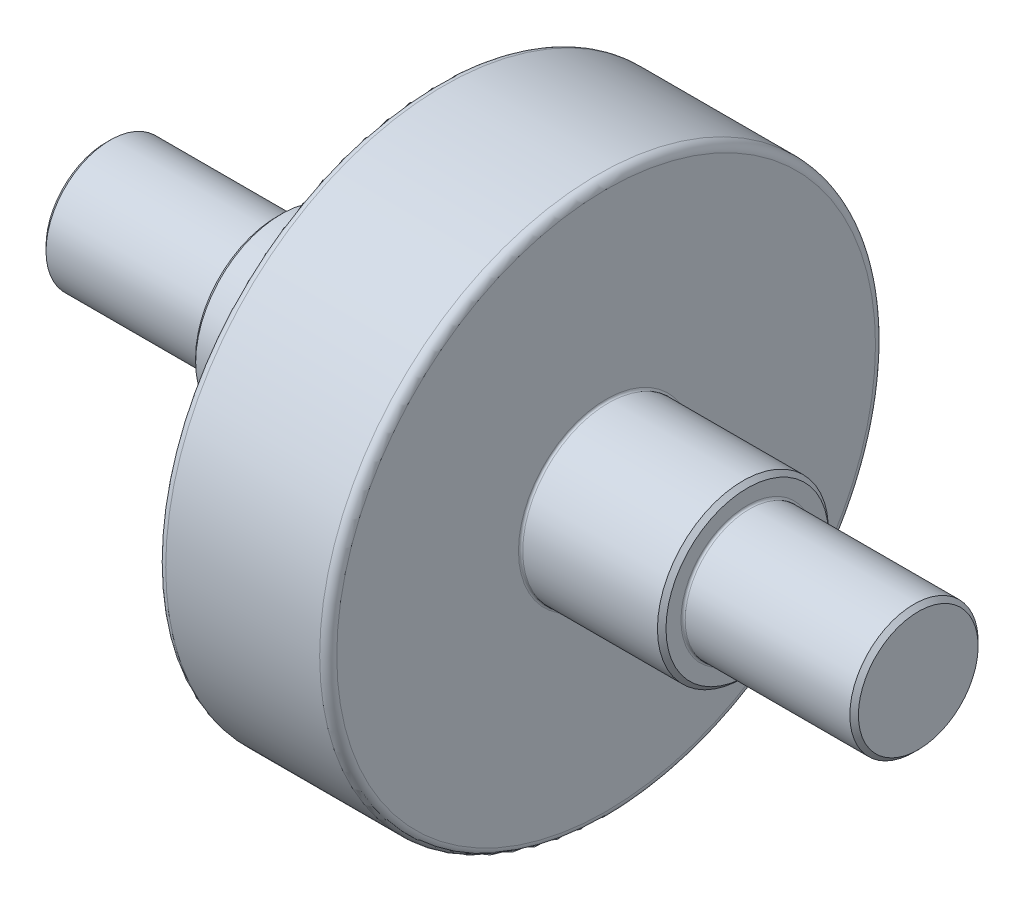
ISO-10303-21;
HEADER;
FILE_DESCRIPTION(('STEP AP214'),'2;1');
FILE_NAME('part.step','',(''),(''),'','','');
FILE_SCHEMA(('AUTOMOTIVE_DESIGN { 1 0 10303 214 1 1 1 1 }'));
ENDSEC;
DATA;
#1=APPLICATION_CONTEXT('core data for automotive mechanical design processes');
#2=APPLICATION_PROTOCOL_DEFINITION('international standard','automotive_design',2000,#1);
#3=PRODUCT_CONTEXT('',#1,'mechanical');
#4=PRODUCT('Part','Part','',(#3));
#5=PRODUCT_RELATED_PRODUCT_CATEGORY('part','',(#4));
#6=PRODUCT_DEFINITION_FORMATION('','',#4);
#7=PRODUCT_DEFINITION_CONTEXT('part definition',#1,'design');
#8=PRODUCT_DEFINITION('design','',#6,#7);
#9=PRODUCT_DEFINITION_SHAPE('','',#8);
#10=(LENGTH_UNIT() NAMED_UNIT(*) SI_UNIT(.MILLI.,.METRE.));
#11=(NAMED_UNIT(*) PLANE_ANGLE_UNIT() SI_UNIT($,.RADIAN.));
#12=(NAMED_UNIT(*) SI_UNIT($,.STERADIAN.) SOLID_ANGLE_UNIT());
#13=UNCERTAINTY_MEASURE_WITH_UNIT(LENGTH_MEASURE(1.E-05),#10,'distance_accuracy_value','');
#14=(GEOMETRIC_REPRESENTATION_CONTEXT(3) GLOBAL_UNCERTAINTY_ASSIGNED_CONTEXT((#13)) GLOBAL_UNIT_ASSIGNED_CONTEXT((#10,
#11,#12)) REPRESENTATION_CONTEXT('',''));
#15=CARTESIAN_POINT('',(0.,0.,0.));
#16=DIRECTION('',(0.,0.,1.));
#17=DIRECTION('',(1.,0.,0.));
#18=AXIS2_PLACEMENT_3D('',#15,#16,#17);
#19=CARTESIAN_POINT('',(0.,0.,0.));
#20=DIRECTION('',(1.,0.,0.));
#21=DIRECTION('',(0.,0.,-1.));
#22=AXIS2_PLACEMENT_3D('',#19,#20,#21);
#23=PLANE('',#22);
#24=CARTESIAN_POINT('',(0.,0.,0.));
#25=DIRECTION('',(-1.,0.,0.));
#26=DIRECTION('',(0.,0.,1.));
#27=AXIS2_PLACEMENT_3D('',#24,#25,#26);
#28=CIRCLE('',#27,14.);
#29=CARTESIAN_POINT('',(0.,0.,14.));
#30=VERTEX_POINT('',#29);
#31=EDGE_CURVE('E10',#30,#30,#28,.T.);
#32=ORIENTED_EDGE('',*,*,#31,.T.);
#33=EDGE_LOOP('',(#32));
#34=FACE_BOUND('',#33,.T.);
#35=ADVANCED_FACE('F32',(#34),#23,.F.);
#36=CARTESIAN_POINT('',(1.,0.,0.));
#37=DIRECTION('',(1.,0.,0.));
#38=DIRECTION('',(0.,0.,-1.));
#39=AXIS2_PLACEMENT_3D('',#36,#37,#38);
#40=CONICAL_SURFACE('',#39,15.,0.785398163397449);
#41=ORIENTED_EDGE('',*,*,#31,.F.);
#42=EDGE_LOOP('',(#41));
#43=FACE_BOUND('',#42,.T.);
#44=CARTESIAN_POINT('',(1.,0.,0.));
#45=DIRECTION('',(-1.,0.,0.));
#46=DIRECTION('',(0.,0.,1.));
#47=AXIS2_PLACEMENT_3D('',#44,#45,#46);
#48=CIRCLE('',#47,15.);
#49=CARTESIAN_POINT('',(1.,0.,15.));
#50=VERTEX_POINT('',#49);
#51=EDGE_CURVE('E38',#50,#50,#48,.T.);
#52=ORIENTED_EDGE('',*,*,#51,.T.);
#53=EDGE_LOOP('',(#52));
#54=FACE_BOUND('',#53,.T.);
#55=ADVANCED_FACE('F112',(#43,#54),#40,.T.);
#56=CARTESIAN_POINT('',(0.,0.,0.));
#57=DIRECTION('',(-1.,0.,0.));
#58=DIRECTION('',(0.,0.,1.));
#59=AXIS2_PLACEMENT_3D('',#56,#57,#58);
#60=CYLINDRICAL_SURFACE('',#59,15.);
#61=ORIENTED_EDGE('',*,*,#51,.F.);
#62=EDGE_LOOP('',(#61));
#63=FACE_BOUND('',#62,.T.);
#64=CARTESIAN_POINT('',(39.5,0.,0.));
#65=DIRECTION('',(-1.,0.,0.));
#66=DIRECTION('',(0.,0.,1.));
#67=AXIS2_PLACEMENT_3D('',#64,#65,#66);
#68=CIRCLE('',#67,15.);
#69=CARTESIAN_POINT('',(39.5,0.,15.));
#70=VERTEX_POINT('',#69);
#71=EDGE_CURVE('E42',#70,#70,#68,.T.);
#72=ORIENTED_EDGE('',*,*,#71,.T.);
#73=EDGE_LOOP('',(#72));
#74=FACE_BOUND('',#73,.T.);
#75=ADVANCED_FACE('F116',(#63,#74),#60,.T.);
#76=CARTESIAN_POINT('',(39.5,0.,0.));
#77=DIRECTION('',(-1.,0.,0.));
#78=DIRECTION('',(0.,0.,1.));
#79=AXIS2_PLACEMENT_3D('',#76,#77,#78);
#80=TOROIDAL_SURFACE('',#79,15.5,0.5);
#81=ORIENTED_EDGE('',*,*,#71,.F.);
#82=EDGE_LOOP('',(#81));
#83=FACE_BOUND('',#82,.T.);
#84=CARTESIAN_POINT('',(40.,0.,0.));
#85=DIRECTION('',(-1.,0.,0.));
#86=DIRECTION('',(0.,0.,1.));
#87=AXIS2_PLACEMENT_3D('',#84,#85,#86);
#88=CIRCLE('',#87,15.5);
#89=CARTESIAN_POINT('',(40.,0.,15.5));
#90=VERTEX_POINT('',#89);
#91=EDGE_CURVE('E46',#90,#90,#88,.T.);
#92=ORIENTED_EDGE('',*,*,#91,.T.);
#93=EDGE_LOOP('',(#92));
#94=FACE_BOUND('',#93,.T.);
#95=ADVANCED_FACE('F121',(#83,#94),#80,.F.);
#96=CARTESIAN_POINT('',(40.,15.5,0.));
#97=DIRECTION('',(1.,0.,0.));
#98=DIRECTION('',(0.,0.,-1.));
#99=AXIS2_PLACEMENT_3D('',#96,#97,#98);
#100=PLANE('',#99);
#101=ORIENTED_EDGE('',*,*,#91,.F.);
#102=EDGE_LOOP('',(#101));
#103=FACE_BOUND('',#102,.T.);
#104=CARTESIAN_POINT('',(40.,0.,0.));
#105=DIRECTION('',(-1.,0.,0.));
#106=DIRECTION('',(0.,0.,1.));
#107=AXIS2_PLACEMENT_3D('',#104,#105,#106);
#108=CIRCLE('',#107,19.);
#109=CARTESIAN_POINT('',(40.,0.,19.));
#110=VERTEX_POINT('',#109);
#111=EDGE_CURVE('E51',#110,#110,#108,.T.);
#112=ORIENTED_EDGE('',*,*,#111,.T.);
#113=EDGE_LOOP('',(#112));
#114=FACE_BOUND('',#113,.T.);
#115=ADVANCED_FACE('F127',(#103,#114),#100,.F.);
#116=CARTESIAN_POINT('',(41.,0.,0.));
#117=DIRECTION('',(1.,0.,0.));
#118=DIRECTION('',(0.,0.,-1.));
#119=AXIS2_PLACEMENT_3D('',#116,#117,#118);
#120=CONICAL_SURFACE('',#119,20.,0.785398163397448);
#121=ORIENTED_EDGE('',*,*,#111,.F.);
#122=EDGE_LOOP('',(#121));
#123=FACE_BOUND('',#122,.T.);
#124=CARTESIAN_POINT('',(41.,0.,0.));
#125=DIRECTION('',(-1.,0.,0.));
#126=DIRECTION('',(0.,0.,1.));
#127=AXIS2_PLACEMENT_3D('',#124,#125,#126);
#128=CIRCLE('',#127,20.);
#129=CARTESIAN_POINT('',(41.,0.,20.));
#130=VERTEX_POINT('',#129);
#131=EDGE_CURVE('E54',#130,#130,#128,.T.);
#132=ORIENTED_EDGE('',*,*,#131,.T.);
#133=EDGE_LOOP('',(#132));
#134=FACE_BOUND('',#133,.T.);
#135=ADVANCED_FACE('F131',(#123,#134),#120,.T.);
#136=CARTESIAN_POINT('',(0.,0.,0.));
#137=DIRECTION('',(-1.,0.,0.));
#138=DIRECTION('',(0.,0.,1.));
#139=AXIS2_PLACEMENT_3D('',#136,#137,#138);
#140=CYLINDRICAL_SURFACE('',#139,20.);
#141=ORIENTED_EDGE('',*,*,#131,.F.);
#142=EDGE_LOOP('',(#141));
#143=FACE_BOUND('',#142,.T.);
#144=CARTESIAN_POINT('',(76.5,0.,0.));
#145=DIRECTION('',(-1.,0.,0.));
#146=DIRECTION('',(0.,0.,1.));
#147=AXIS2_PLACEMENT_3D('',#144,#145,#146);
#148=CIRCLE('',#147,20.);
#149=CARTESIAN_POINT('',(76.5,0.,20.));
#150=VERTEX_POINT('',#149);
#151=EDGE_CURVE('E57',#150,#150,#148,.T.);
#152=ORIENTED_EDGE('',*,*,#151,.T.);
#153=EDGE_LOOP('',(#152));
#154=FACE_BOUND('',#153,.T.);
#155=ADVANCED_FACE('F135',(#143,#154),#140,.T.);
#156=CARTESIAN_POINT('',(76.5,0.,0.));
#157=DIRECTION('',(-1.,0.,0.));
#158=DIRECTION('',(0.,0.,1.));
#159=AXIS2_PLACEMENT_3D('',#156,#157,#158);
#160=TOROIDAL_SURFACE('',#159,20.5,0.5);
#161=ORIENTED_EDGE('',*,*,#151,.F.);
#162=EDGE_LOOP('',(#161));
#163=FACE_BOUND('',#162,.T.);
#164=CARTESIAN_POINT('',(77.,0.,0.));
#165=DIRECTION('',(-1.,0.,0.));
#166=DIRECTION('',(0.,0.,1.));
#167=AXIS2_PLACEMENT_3D('',#164,#165,#166);
#168=CIRCLE('',#167,20.5);
#169=CARTESIAN_POINT('',(77.,0.,20.5));
#170=VERTEX_POINT('',#169);
#171=EDGE_CURVE('E60',#170,#170,#168,.T.);
#172=ORIENTED_EDGE('',*,*,#171,.T.);
#173=EDGE_LOOP('',(#172));
#174=FACE_BOUND('',#173,.T.);
#175=ADVANCED_FACE('F139',(#163,#174),#160,.F.);
#176=CARTESIAN_POINT('',(77.,20.5,0.));
#177=DIRECTION('',(1.,0.,0.));
#178=DIRECTION('',(0.,0.,-1.));
#179=AXIS2_PLACEMENT_3D('',#176,#177,#178);
#180=PLANE('',#179);
#181=ORIENTED_EDGE('',*,*,#171,.F.);
#182=EDGE_LOOP('',(#181));
#183=FACE_BOUND('',#182,.T.);
#184=CARTESIAN_POINT('',(77.,0.,0.));
#185=DIRECTION('',(-1.,0.,0.));
#186=DIRECTION('',(0.,0.,1.));
#187=AXIS2_PLACEMENT_3D('',#184,#185,#186);
#188=CIRCLE('',#187,63.);
#189=CARTESIAN_POINT('',(77.,0.,63.));
#190=VERTEX_POINT('',#189);
#191=EDGE_CURVE('E63',#190,#190,#188,.T.);
#192=ORIENTED_EDGE('',*,*,#191,.T.);
#193=EDGE_LOOP('',(#192));
#194=FACE_BOUND('',#193,.T.);
#195=ADVANCED_FACE('F143',(#183,#194),#180,.F.);
#196=CARTESIAN_POINT('',(79.,0.,0.));
#197=DIRECTION('',(-1.,0.,0.));
#198=DIRECTION('',(0.,0.,1.));
#199=AXIS2_PLACEMENT_3D('',#196,#197,#198);
#200=TOROIDAL_SURFACE('',#199,63.,2.);
#201=ORIENTED_EDGE('',*,*,#191,.F.);
#202=EDGE_LOOP('',(#201));
#203=FACE_BOUND('',#202,.T.);
#204=CARTESIAN_POINT('',(79.,0.,0.));
#205=DIRECTION('',(-1.,0.,0.));
#206=DIRECTION('',(0.,0.,1.));
#207=AXIS2_PLACEMENT_3D('',#204,#205,#206);
#208=CIRCLE('',#207,65.);
#209=CARTESIAN_POINT('',(79.,0.,65.));
#210=VERTEX_POINT('',#209);
#211=EDGE_CURVE('E66',#210,#210,#208,.T.);
#212=ORIENTED_EDGE('',*,*,#211,.T.);
#213=EDGE_LOOP('',(#212));
#214=FACE_BOUND('',#213,.T.);
#215=ADVANCED_FACE('F147',(#203,#214),#200,.T.);
#216=CARTESIAN_POINT('',(0.,0.,0.));
#217=DIRECTION('',(-1.,0.,0.));
#218=DIRECTION('',(0.,0.,1.));
#219=AXIS2_PLACEMENT_3D('',#216,#217,#218);
#220=CYLINDRICAL_SURFACE('',#219,65.);
#221=ORIENTED_EDGE('',*,*,#211,.F.);
#222=EDGE_LOOP('',(#221));
#223=FACE_BOUND('',#222,.T.);
#224=CARTESIAN_POINT('',(115.,0.,0.));
#225=DIRECTION('',(-1.,0.,0.));
#226=DIRECTION('',(0.,0.,1.));
#227=AXIS2_PLACEMENT_3D('',#224,#225,#226);
#228=CIRCLE('',#227,65.);
#229=CARTESIAN_POINT('',(115.,0.,65.));
#230=VERTEX_POINT('',#229);
#231=EDGE_CURVE('E69',#230,#230,#228,.T.);
#232=ORIENTED_EDGE('',*,*,#231,.T.);
#233=EDGE_LOOP('',(#232));
#234=FACE_BOUND('',#233,.T.);
#235=ADVANCED_FACE('F151',(#223,#234),#220,.T.);
#236=CARTESIAN_POINT('',(115.,0.,0.));
#237=DIRECTION('',(-1.,0.,0.));
#238=DIRECTION('',(0.,0.,1.));
#239=AXIS2_PLACEMENT_3D('',#236,#237,#238);
#240=TOROIDAL_SURFACE('',#239,63.,2.);
#241=ORIENTED_EDGE('',*,*,#231,.F.);
#242=EDGE_LOOP('',(#241));
#243=FACE_BOUND('',#242,.T.);
#244=CARTESIAN_POINT('',(117.,0.,0.));
#245=DIRECTION('',(-1.,0.,0.));
#246=DIRECTION('',(0.,0.,1.));
#247=AXIS2_PLACEMENT_3D('',#244,#245,#246);
#248=CIRCLE('',#247,63.);
#249=CARTESIAN_POINT('',(117.,0.,63.));
#250=VERTEX_POINT('',#249);
#251=EDGE_CURVE('E72',#250,#250,#248,.T.);
#252=ORIENTED_EDGE('',*,*,#251,.T.);
#253=EDGE_LOOP('',(#252));
#254=FACE_BOUND('',#253,.T.);
#255=ADVANCED_FACE('F155',(#243,#254),#240,.T.);
#256=CARTESIAN_POINT('',(117.,20.5,0.));
#257=DIRECTION('',(-1.,0.,0.));
#258=DIRECTION('',(0.,0.,1.));
#259=AXIS2_PLACEMENT_3D('',#256,#257,#258);
#260=PLANE('',#259);
#261=ORIENTED_EDGE('',*,*,#251,.F.);
#262=EDGE_LOOP('',(#261));
#263=FACE_BOUND('',#262,.T.);
#264=CARTESIAN_POINT('',(117.,0.,0.));
#265=DIRECTION('',(-1.,0.,0.));
#266=DIRECTION('',(0.,0.,1.));
#267=AXIS2_PLACEMENT_3D('',#264,#265,#266);
#268=CIRCLE('',#267,20.5);
#269=CARTESIAN_POINT('',(117.,0.,20.5));
#270=VERTEX_POINT('',#269);
#271=EDGE_CURVE('E75',#270,#270,#268,.T.);
#272=ORIENTED_EDGE('',*,*,#271,.T.);
#273=EDGE_LOOP('',(#272));
#274=FACE_BOUND('',#273,.T.);
#275=ADVANCED_FACE('F159',(#263,#274),#260,.F.);
#276=CARTESIAN_POINT('',(117.5,0.,0.));
#277=DIRECTION('',(-1.,0.,0.));
#278=DIRECTION('',(0.,0.,1.));
#279=AXIS2_PLACEMENT_3D('',#276,#277,#278);
#280=TOROIDAL_SURFACE('',#279,20.5,0.500000000000002);
#281=ORIENTED_EDGE('',*,*,#271,.F.);
#282=EDGE_LOOP('',(#281));
#283=FACE_BOUND('',#282,.T.);
#284=CARTESIAN_POINT('',(117.5,0.,0.));
#285=DIRECTION('',(-1.,0.,0.));
#286=DIRECTION('',(0.,0.,1.));
#287=AXIS2_PLACEMENT_3D('',#284,#285,#286);
#288=CIRCLE('',#287,20.);
#289=CARTESIAN_POINT('',(117.5,0.,20.));
#290=VERTEX_POINT('',#289);
#291=EDGE_CURVE('E78',#290,#290,#288,.T.);
#292=ORIENTED_EDGE('',*,*,#291,.T.);
#293=EDGE_LOOP('',(#292));
#294=FACE_BOUND('',#293,.T.);
#295=ADVANCED_FACE('F163',(#283,#294),#280,.F.);
#296=CARTESIAN_POINT('',(0.,0.,0.));
#297=DIRECTION('',(-1.,0.,0.));
#298=DIRECTION('',(0.,0.,1.));
#299=AXIS2_PLACEMENT_3D('',#296,#297,#298);
#300=CYLINDRICAL_SURFACE('',#299,20.);
#301=ORIENTED_EDGE('',*,*,#291,.F.);
#302=EDGE_LOOP('',(#301));
#303=FACE_BOUND('',#302,.T.);
#304=CARTESIAN_POINT('',(149.,0.,0.));
#305=DIRECTION('',(-1.,0.,0.));
#306=DIRECTION('',(0.,0.,1.));
#307=AXIS2_PLACEMENT_3D('',#304,#305,#306);
#308=CIRCLE('',#307,20.);
#309=CARTESIAN_POINT('',(149.,0.,20.));
#310=VERTEX_POINT('',#309);
#311=EDGE_CURVE('E81',#310,#310,#308,.T.);
#312=ORIENTED_EDGE('',*,*,#311,.T.);
#313=EDGE_LOOP('',(#312));
#314=FACE_BOUND('',#313,.T.);
#315=ADVANCED_FACE('F167',(#303,#314),#300,.T.);
#316=CARTESIAN_POINT('',(150.,0.,0.));
#317=DIRECTION('',(-1.,0.,0.));
#318=DIRECTION('',(0.,0.,1.));
#319=AXIS2_PLACEMENT_3D('',#316,#317,#318);
#320=CONICAL_SURFACE('',#319,19.,0.785398163397448);
#321=ORIENTED_EDGE('',*,*,#311,.F.);
#322=EDGE_LOOP('',(#321));
#323=FACE_BOUND('',#322,.T.);
#324=CARTESIAN_POINT('',(150.,0.,0.));
#325=DIRECTION('',(-1.,0.,0.));
#326=DIRECTION('',(0.,0.,1.));
#327=AXIS2_PLACEMENT_3D('',#324,#325,#326);
#328=CIRCLE('',#327,19.);
#329=CARTESIAN_POINT('',(150.,0.,19.));
#330=VERTEX_POINT('',#329);
#331=EDGE_CURVE('E84',#330,#330,#328,.T.);
#332=ORIENTED_EDGE('',*,*,#331,.T.);
#333=EDGE_LOOP('',(#332));
#334=FACE_BOUND('',#333,.T.);
#335=ADVANCED_FACE('F171',(#323,#334),#320,.T.);
#336=CARTESIAN_POINT('',(150.,15.5,0.));
#337=DIRECTION('',(-1.,0.,0.));
#338=DIRECTION('',(0.,0.,1.));
#339=AXIS2_PLACEMENT_3D('',#336,#337,#338);
#340=PLANE('',#339);
#341=ORIENTED_EDGE('',*,*,#331,.F.);
#342=EDGE_LOOP('',(#341));
#343=FACE_BOUND('',#342,.T.);
#344=CARTESIAN_POINT('',(150.,0.,0.));
#345=DIRECTION('',(-1.,0.,0.));
#346=DIRECTION('',(0.,0.,1.));
#347=AXIS2_PLACEMENT_3D('',#344,#345,#346);
#348=CIRCLE('',#347,15.5);
#349=CARTESIAN_POINT('',(150.,0.,15.5));
#350=VERTEX_POINT('',#349);
#351=EDGE_CURVE('E87',#350,#350,#348,.T.);
#352=ORIENTED_EDGE('',*,*,#351,.T.);
#353=EDGE_LOOP('',(#352));
#354=FACE_BOUND('',#353,.T.);
#355=ADVANCED_FACE('F175',(#343,#354),#340,.F.);
#356=CARTESIAN_POINT('',(150.5,0.,0.));
#357=DIRECTION('',(-1.,0.,0.));
#358=DIRECTION('',(0.,0.,1.));
#359=AXIS2_PLACEMENT_3D('',#356,#357,#358);
#360=TOROIDAL_SURFACE('',#359,15.5,0.5);
#361=ORIENTED_EDGE('',*,*,#351,.F.);
#362=EDGE_LOOP('',(#361));
#363=FACE_BOUND('',#362,.T.);
#364=CARTESIAN_POINT('',(150.5,0.,0.));
#365=DIRECTION('',(-1.,0.,0.));
#366=DIRECTION('',(0.,0.,1.));
#367=AXIS2_PLACEMENT_3D('',#364,#365,#366);
#368=CIRCLE('',#367,15.);
#369=CARTESIAN_POINT('',(150.5,0.,15.));
#370=VERTEX_POINT('',#369);
#371=EDGE_CURVE('E90',#370,#370,#368,.T.);
#372=ORIENTED_EDGE('',*,*,#371,.T.);
#373=EDGE_LOOP('',(#372));
#374=FACE_BOUND('',#373,.T.);
#375=ADVANCED_FACE('F179',(#363,#374),#360,.F.);
#376=CARTESIAN_POINT('',(0.,0.,0.));
#377=DIRECTION('',(-1.,0.,0.));
#378=DIRECTION('',(0.,0.,1.));
#379=AXIS2_PLACEMENT_3D('',#376,#377,#378);
#380=CYLINDRICAL_SURFACE('',#379,15.);
#381=ORIENTED_EDGE('',*,*,#371,.F.);
#382=EDGE_LOOP('',(#381));
#383=FACE_BOUND('',#382,.T.);
#384=CARTESIAN_POINT('',(189.,0.,0.));
#385=DIRECTION('',(-1.,0.,0.));
#386=DIRECTION('',(0.,0.,1.));
#387=AXIS2_PLACEMENT_3D('',#384,#385,#386);
#388=CIRCLE('',#387,15.);
#389=CARTESIAN_POINT('',(189.,0.,15.));
#390=VERTEX_POINT('',#389);
#391=EDGE_CURVE('E93',#390,#390,#388,.T.);
#392=ORIENTED_EDGE('',*,*,#391,.T.);
#393=EDGE_LOOP('',(#392));
#394=FACE_BOUND('',#393,.T.);
#395=ADVANCED_FACE('F108',(#383,#394),#380,.T.);
#396=CARTESIAN_POINT('',(190.,0.,0.));
#397=DIRECTION('',(-1.,0.,0.));
#398=DIRECTION('',(0.,0.,1.));
#399=AXIS2_PLACEMENT_3D('',#396,#397,#398);
#400=CONICAL_SURFACE('',#399,14.,0.785398163397448);
#401=ORIENTED_EDGE('',*,*,#391,.F.);
#402=EDGE_LOOP('',(#401));
#403=FACE_BOUND('',#402,.T.);
#404=CARTESIAN_POINT('',(190.,0.,0.));
#405=DIRECTION('',(-1.,0.,0.));
#406=DIRECTION('',(0.,0.,1.));
#407=AXIS2_PLACEMENT_3D('',#404,#405,#406);
#408=CIRCLE('',#407,14.);
#409=CARTESIAN_POINT('',(190.,0.,14.));
#410=VERTEX_POINT('',#409);
#411=EDGE_CURVE('E96',#410,#410,#408,.T.);
#412=ORIENTED_EDGE('',*,*,#411,.T.);
#413=EDGE_LOOP('',(#412));
#414=FACE_BOUND('',#413,.T.);
#415=ADVANCED_FACE('F100',(#403,#414),#400,.T.);
#416=CARTESIAN_POINT('',(190.,0.,0.));
#417=DIRECTION('',(-1.,0.,0.));
#418=DIRECTION('',(0.,0.,1.));
#419=AXIS2_PLACEMENT_3D('',#416,#417,#418);
#420=PLANE('',#419);
#421=ORIENTED_EDGE('',*,*,#411,.F.);
#422=EDGE_LOOP('',(#421));
#423=FACE_BOUND('',#422,.T.);
#424=ADVANCED_FACE('F102',(#423),#420,.F.);
#425=CLOSED_SHELL('',(#35,#55,#75,#95,#115,#135,#155,#175,#195,#215,#235,#255,#275,#295,#315,
#335,#355,#375,#395,#415,#424));
#426=MANIFOLD_SOLID_BREP('B2',#425);
#427=ADVANCED_BREP_SHAPE_REPRESENTATION('',(#18,#426),#14);
#428=SHAPE_DEFINITION_REPRESENTATION(#9,#427);
ENDSEC;
END-ISO-10303-21;
